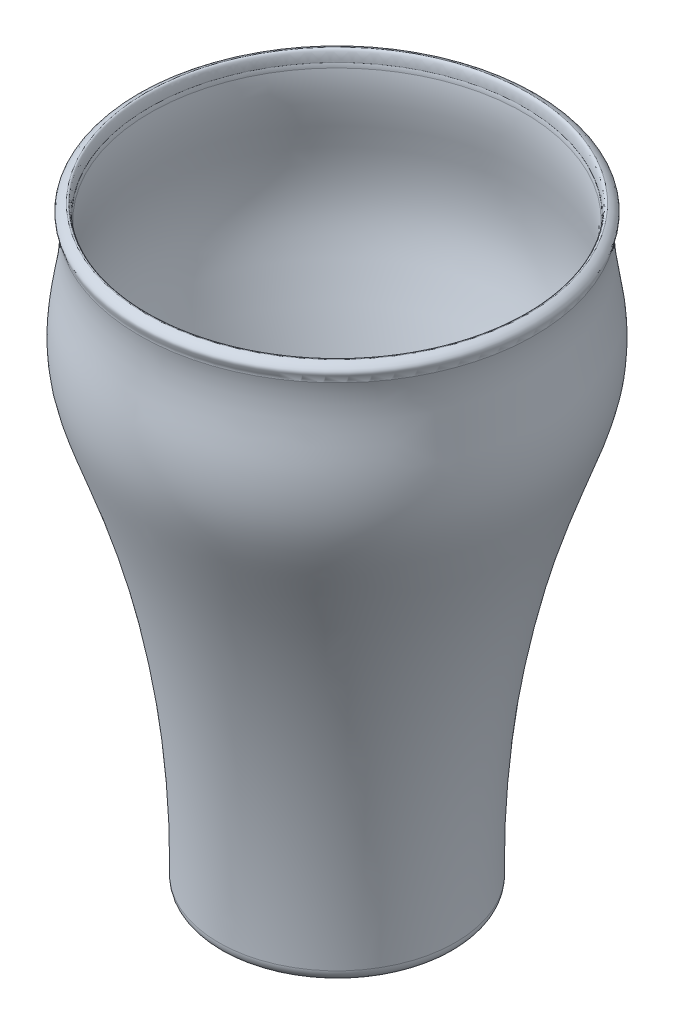
ISO-10303-21;
HEADER;
FILE_DESCRIPTION(('STEP AP214'),'2;1');
FILE_NAME('part.step','',(''),(''),'','','');
FILE_SCHEMA(('AUTOMOTIVE_DESIGN { 1 0 10303 214 1 1 1 1 }'));
ENDSEC;
DATA;
#1=APPLICATION_CONTEXT('core data for automotive mechanical design processes');
#2=APPLICATION_PROTOCOL_DEFINITION('international standard','automotive_design',2000,#1);
#3=PRODUCT_CONTEXT('',#1,'mechanical');
#4=PRODUCT('Part','Part','',(#3));
#5=PRODUCT_RELATED_PRODUCT_CATEGORY('part','',(#4));
#6=PRODUCT_DEFINITION_FORMATION('','',#4);
#7=PRODUCT_DEFINITION_CONTEXT('part definition',#1,'design');
#8=PRODUCT_DEFINITION('design','',#6,#7);
#9=PRODUCT_DEFINITION_SHAPE('','',#8);
#10=(LENGTH_UNIT() NAMED_UNIT(*) SI_UNIT(.MILLI.,.METRE.));
#11=(NAMED_UNIT(*) PLANE_ANGLE_UNIT() SI_UNIT($,.RADIAN.));
#12=(NAMED_UNIT(*) SI_UNIT($,.STERADIAN.) SOLID_ANGLE_UNIT());
#13=UNCERTAINTY_MEASURE_WITH_UNIT(LENGTH_MEASURE(1.E-05),#10,'distance_accuracy_value','');
#14=(GEOMETRIC_REPRESENTATION_CONTEXT(3) GLOBAL_UNCERTAINTY_ASSIGNED_CONTEXT((#13)) GLOBAL_UNIT_ASSIGNED_CONTEXT((#10,
#11,#12)) REPRESENTATION_CONTEXT('',''));
#15=CARTESIAN_POINT('',(0.,0.,0.));
#16=DIRECTION('',(0.,0.,1.));
#17=DIRECTION('',(1.,0.,0.));
#18=AXIS2_PLACEMENT_3D('',#15,#16,#17);
#19=CARTESIAN_POINT('',(-40.161712896509,67.7639787968205,0.));
#20=CARTESIAN_POINT('',(-40.2078607651038,67.5717075587349,0.));
#21=CARTESIAN_POINT('',(-40.1071310294182,70.3157519524283,0.));
#22=CARTESIAN_POINT('',(-40.982771359121,70.0372787968205,0.));
#23=B_SPLINE_CURVE_WITH_KNOTS('',3,(#19,#20,#21,#22),.UNSPECIFIED.,.F.,.F.,(4,4),(0.,1.),.UNSPECIFIED.);
#24=CARTESIAN_POINT('',(0.,70.0372787968205,0.));
#25=DIRECTION('',(0.,1.,0.));
#26=AXIS1_PLACEMENT('',#24,#25);
#27=SURFACE_OF_REVOLUTION('',#23,#26);
#28=CARTESIAN_POINT('',(0.,70.0372787968205,0.));
#29=DIRECTION('',(0.,1.,0.));
#30=DIRECTION('',(0.,0.,1.));
#31=AXIS2_PLACEMENT_3D('',#28,#29,#30);
#32=CIRCLE('',#31,40.982771359121);
#33=CARTESIAN_POINT('',(0.,70.0372787968205,40.982771359121));
#34=VERTEX_POINT('',#33);
#35=EDGE_CURVE('E55',#34,#34,#32,.T.);
#36=ORIENTED_EDGE('',*,*,#35,.T.);
#37=EDGE_LOOP('',(#36));
#38=FACE_BOUND('',#37,.T.);
#39=CARTESIAN_POINT('',(0.,67.7639787968204,0.));
#40=DIRECTION('',(0.,1.,0.));
#41=DIRECTION('',(0.,0.,1.));
#42=AXIS2_PLACEMENT_3D('',#39,#40,#41);
#43=CIRCLE('',#42,40.161712896509);
#44=CARTESIAN_POINT('',(0.,67.7639787968204,40.161712896509));
#45=VERTEX_POINT('',#44);
#46=EDGE_CURVE('E64',#45,#45,#43,.T.);
#47=ORIENTED_EDGE('',*,*,#46,.F.);
#48=EDGE_LOOP('',(#47));
#49=FACE_BOUND('',#48,.T.);
#50=ADVANCED_FACE('F35',(#38,#49),#27,.F.);
#51=CARTESIAN_POINT('',(-40.982771359121,70.0372787968205,0.));
#52=CARTESIAN_POINT('',(-41.2540907274996,69.9509931860201,0.));
#53=CARTESIAN_POINT('',(-42.0560883488878,69.5973016641883,0.));
#54=CARTESIAN_POINT('',(-43.2005948521179,68.4430159210826,0.));
#55=CARTESIAN_POINT('',(-42.2332897103566,67.3090777516899,0.));
#56=CARTESIAN_POINT('',(-42.2864520805664,66.6426140384527,0.));
#57=B_SPLINE_CURVE_WITH_KNOTS('',3,(#51,#52,#53,#54,#55,#56),.UNSPECIFIED.,.F.,.F.,(4,1,1,4),
(0.,0.262566933204371,0.525656658847653,1.),.UNSPECIFIED.);
#58=CARTESIAN_POINT('',(0.,70.0372787968205,0.));
#59=DIRECTION('',(0.,1.,0.));
#60=AXIS1_PLACEMENT('',#58,#59);
#61=SURFACE_OF_REVOLUTION('',#57,#60);
#62=CARTESIAN_POINT('',(0.,66.6426140384527,0.));
#63=DIRECTION('',(0.,1.,0.));
#64=DIRECTION('',(0.,0.,1.));
#65=AXIS2_PLACEMENT_3D('',#62,#63,#64);
#66=CIRCLE('',#65,42.2864520805664);
#67=CARTESIAN_POINT('',(0.,66.6426140384527,42.2864520805664));
#68=VERTEX_POINT('',#67);
#69=EDGE_CURVE('E58',#68,#68,#66,.T.);
#70=ORIENTED_EDGE('',*,*,#69,.T.);
#71=EDGE_LOOP('',(#70));
#72=FACE_BOUND('',#71,.T.);
#73=ORIENTED_EDGE('',*,*,#35,.F.);
#74=EDGE_LOOP('',(#73));
#75=FACE_BOUND('',#74,.T.);
#76=ADVANCED_FACE('F98',(#72,#75),#61,.F.);
#77=CARTESIAN_POINT('',(-42.2864520805664,66.6426140384527,0.));
#78=CARTESIAN_POINT('',(-41.7851341456587,63.8343197516039,0.));
#79=CARTESIAN_POINT('',(-42.2065413611083,58.4269283923178,0.));
#80=CARTESIAN_POINT('',(-43.9755250202174,49.6278971925327,0.));
#81=CARTESIAN_POINT('',(-44.1380980893129,39.0617469269642,0.));
#82=CARTESIAN_POINT('',(-40.0103161028563,27.5218041267874,0.));
#83=CARTESIAN_POINT('',(-28.8072692358302,-3.41779929685816,0.));
#84=CARTESIAN_POINT('',(-24.8923245590568,-32.5522426631839,0.));
#85=CARTESIAN_POINT('',(-25.4070828595563,-56.9627212031795,0.));
#86=B_SPLINE_CURVE_WITH_KNOTS('',3,(#77,#78,#79,#80,#81,#82,#83,#84,#85),.UNSPECIFIED.,.F.,.F.,
(4,1,1,1,1,1,4),(0.,0.0675260052343535,0.127886176615294,0.214327329654211,0.314756995417671,
0.416925229903026,1.),.UNSPECIFIED.);
#87=CARTESIAN_POINT('',(0.,70.0372787968205,0.));
#88=DIRECTION('',(0.,1.,0.));
#89=AXIS1_PLACEMENT('',#87,#88);
#90=SURFACE_OF_REVOLUTION('',#86,#89);
#91=CARTESIAN_POINT('',(0.,-54.3972602507916,0.));
#92=DIRECTION('',(0.,1.,0.));
#93=DIRECTION('',(0.,0.,1.));
#94=AXIS2_PLACEMENT_3D('',#91,#92,#93);
#95=CIRCLE('',#94,25.3671736585105);
#96=CARTESIAN_POINT('',(0.,-54.3972602507916,25.3671736585105));
#97=VERTEX_POINT('',#96);
#98=EDGE_CURVE('E42',#97,#97,#95,.T.);
#99=ORIENTED_EDGE('',*,*,#98,.T.);
#100=EDGE_LOOP('',(#99));
#101=FACE_BOUND('',#100,.T.);
#102=ORIENTED_EDGE('',*,*,#69,.F.);
#103=EDGE_LOOP('',(#102));
#104=FACE_BOUND('',#103,.T.);
#105=ADVANCED_FACE('F95',(#101,#104),#90,.F.);
#106=CARTESIAN_POINT('',(-25.4070828595563,-56.9627212031795,0.));
#107=DIRECTION('',(0.,-1.,0.));
#108=DIRECTION('',(0.,0.,-1.));
#109=AXIS2_PLACEMENT_3D('',#106,#107,#108);
#110=PLANE('',#109);
#111=CARTESIAN_POINT('',(0.,-56.9627212031795,0.));
#112=DIRECTION('',(0.,-1.,0.));
#113=DIRECTION('',(0.,0.,-1.));
#114=AXIS2_PLACEMENT_3D('',#111,#112,#113);
#115=CIRCLE('',#114,22.8273012719715);
#116=CARTESIAN_POINT('',(0.,-56.9627212031795,-22.8273012719715));
#117=VERTEX_POINT('',#116);
#118=EDGE_CURVE('E10',#117,#117,#115,.T.);
#119=ORIENTED_EDGE('',*,*,#118,.T.);
#120=EDGE_LOOP('',(#119));
#121=FACE_BOUND('',#120,.T.);
#122=ADVANCED_FACE('F91',(#121),#110,.T.);
#123=CARTESIAN_POINT('',(-23.0968431742677,-54.6894212031795,0.));
#124=DIRECTION('',(0.,1.,0.));
#125=DIRECTION('',(0.,0.,1.));
#126=AXIS2_PLACEMENT_3D('',#123,#124,#125);
#127=PLANE('',#126);
#128=CARTESIAN_POINT('',(0.,-54.6894212031795,0.));
#129=DIRECTION('',(0.,1.,0.));
#130=DIRECTION('',(0.,0.,1.));
#131=AXIS2_PLACEMENT_3D('',#128,#129,#130);
#132=CIRCLE('',#131,20.5422025735924);
#133=CARTESIAN_POINT('',(0.,-54.6894212031795,20.5422025735924));
#134=VERTEX_POINT('',#133);
#135=EDGE_CURVE('E50',#134,#134,#132,.T.);
#136=ORIENTED_EDGE('',*,*,#135,.T.);
#137=EDGE_LOOP('',(#136));
#138=FACE_BOUND('',#137,.T.);
#139=ADVANCED_FACE('F87',(#138),#127,.T.);
#140=CARTESIAN_POINT('',(-23.0968431742677,-54.6894212031795,0.));
#141=CARTESIAN_POINT('',(-23.0388018808749,-49.4956010295479,0.));
#142=CARTESIAN_POINT('',(-23.2671468092924,-39.1117391751753,0.));
#143=CARTESIAN_POINT('',(-24.6640408221197,-23.5304935903916,0.));
#144=CARTESIAN_POINT('',(-27.1385340711321,-8.08213544029553,0.));
#145=CARTESIAN_POINT('',(-30.118090666955,4.59327544088663,0.));
#146=CARTESIAN_POINT('',(-33.063765775765,14.5721306034255,0.));
#147=CARTESIAN_POINT('',(-35.5578305099025,21.9301697556452,0.));
#148=CARTESIAN_POINT('',(-38.2199467397921,29.2318545284125,0.));
#149=CARTESIAN_POINT('',(-40.3025451650946,35.2101062461546,0.));
#150=CARTESIAN_POINT('',(-41.3249648057782,39.917518024567,0.));
#151=CARTESIAN_POINT('',(-41.6726926133105,43.4964507904898,0.));
#152=CARTESIAN_POINT('',(-41.6499140273339,47.1720767326186,0.));
#153=CARTESIAN_POINT('',(-41.1877643334059,52.0481291724909,0.));
#154=CARTESIAN_POINT('',(-40.1657108551781,57.0558543785063,0.));
#155=CARTESIAN_POINT('',(-39.6955868407625,61.8472941941081,0.));
#156=CARTESIAN_POINT('',(-39.7342856442041,64.6647024235412,0.));
#157=CARTESIAN_POINT('',(-39.892609452884,66.1153693405419,0.));
#158=CARTESIAN_POINT('',(-40.0114661175859,66.8274868068968,0.));
#159=B_SPLINE_CURVE_WITH_KNOTS('',3,(#140,#141,#142,#143,#144,#145,#146,#147,#148,#149,#150,
#151,#152,#153,#154,#155,#156,#157,#158),.UNSPECIFIED.,.F.,.F.,(4,1,1,1,1,1,1,1,1,1,1,1,1,1,1,1,
4),(0.00151731272923951,0.124040898531078,0.246564484332917,0.369088070134756,0.491611655936594,
0.552873448837513,0.614135241738433,0.675397034639352,0.736658827540272,0.767289723990731,
0.797920620441191,0.828551516891651,0.85918241334211,0.920444206243029,0.951075102693489,
0.966390550918719,0.981705999143949),.UNSPECIFIED.);
#160=CARTESIAN_POINT('',(0.,70.0372787968205,0.));
#161=DIRECTION('',(0.,1.,0.));
#162=AXIS1_PLACEMENT('',#160,#161);
#163=SURFACE_OF_REVOLUTION('',#159,#162);
#164=CARTESIAN_POINT('',(0.,-52.1485511505559,0.));
#165=DIRECTION('',(0.,1.,0.));
#166=DIRECTION('',(0.,0.,1.));
#167=AXIS2_PLACEMENT_3D('',#164,#165,#166);
#168=CIRCLE('',#167,23.0822024245783);
#169=CARTESIAN_POINT('',(0.,-52.1485511505559,23.0822024245783));
#170=VERTEX_POINT('',#169);
#171=EDGE_CURVE('E46',#170,#170,#168,.F.);
#172=ORIENTED_EDGE('',*,*,#171,.T.);
#173=EDGE_LOOP('',(#172));
#174=FACE_BOUND('',#173,.T.);
#175=CARTESIAN_POINT('',(0.,66.8274868068968,0.));
#176=DIRECTION('',(0.,1.,0.));
#177=DIRECTION('',(0.,0.,1.));
#178=AXIS2_PLACEMENT_3D('',#175,#176,#177);
#179=CIRCLE('',#178,40.0114661175859);
#180=CARTESIAN_POINT('',(0.,66.8274868068968,40.0114661175859));
#181=VERTEX_POINT('',#180);
#182=EDGE_CURVE('E61',#181,#181,#179,.T.);
#183=ORIENTED_EDGE('',*,*,#182,.T.);
#184=EDGE_LOOP('',(#183));
#185=FACE_BOUND('',#184,.T.);
#186=ADVANCED_FACE('F83',(#174,#185),#163,.F.);
#187=CARTESIAN_POINT('',(-40.0114661175859,66.8274868068968,0.));
#188=CARTESIAN_POINT('',(-40.0142032808106,66.9183107443465,0.));
#189=CARTESIAN_POINT('',(-40.0277667050731,67.1058024024993,0.));
#190=CARTESIAN_POINT('',(-40.0635241005001,67.3487962790065,0.));
#191=CARTESIAN_POINT('',(-40.1101848510301,67.5720530106901,0.));
#192=CARTESIAN_POINT('',(-40.1432353860497,67.6985362970015,0.));
#193=CARTESIAN_POINT('',(-40.161712896509,67.7639787968204,0.));
#194=B_SPLINE_CURVE_WITH_KNOTS('',3,(#187,#188,#189,#190,#191,#192,#193),.UNSPECIFIED.,.F.,.F.,
(4,1,1,1,4),(0.882607163181234,0.905087451232894,0.927567739284554,0.950048027336214,
0.972528315387874),.UNSPECIFIED.);
#195=CARTESIAN_POINT('',(0.,70.0372787968205,0.));
#196=DIRECTION('',(0.,1.,0.));
#197=AXIS1_PLACEMENT('',#195,#196);
#198=SURFACE_OF_REVOLUTION('',#194,#197);
#199=ORIENTED_EDGE('',*,*,#46,.T.);
#200=EDGE_LOOP('',(#199));
#201=FACE_BOUND('',#200,.T.);
#202=ORIENTED_EDGE('',*,*,#182,.F.);
#203=EDGE_LOOP('',(#202));
#204=FACE_BOUND('',#203,.T.);
#205=ADVANCED_FACE('F79',(#201,#204),#198,.F.);
#206=CARTESIAN_POINT('',(0.,-52.1494212031795,0.));
#207=DIRECTION('',(0.,1.,0.));
#208=DIRECTION('',(0.,0.,1.));
#209=AXIS2_PLACEMENT_3D('',#206,#207,#208);
#210=TOROIDAL_SURFACE('',#209,20.5422025735924,2.54);
#211=ORIENTED_EDGE('',*,*,#171,.F.);
#212=EDGE_LOOP('',(#211));
#213=FACE_BOUND('',#212,.T.);
#214=ORIENTED_EDGE('',*,*,#135,.F.);
#215=EDGE_LOOP('',(#214));
#216=FACE_BOUND('',#215,.T.);
#217=ADVANCED_FACE('F82',(#213,#216),#210,.F.);
#218=CARTESIAN_POINT('',(0.,-54.4227212031794,0.));
#219=DIRECTION('',(0.,1.,0.));
#220=DIRECTION('',(0.,0.,1.));
#221=AXIS2_PLACEMENT_3D('',#218,#219,#220);
#222=TOROIDAL_SURFACE('',#221,22.8273012719715,2.54);
#223=ORIENTED_EDGE('',*,*,#118,.F.);
#224=EDGE_LOOP('',(#223));
#225=FACE_BOUND('',#224,.T.);
#226=ORIENTED_EDGE('',*,*,#98,.F.);
#227=EDGE_LOOP('',(#226));
#228=FACE_BOUND('',#227,.T.);
#229=ADVANCED_FACE('F37',(#225,#228),#222,.T.);
#230=CLOSED_SHELL('',(#50,#76,#105,#122,#139,#186,#205,#217,#229));
#231=MANIFOLD_SOLID_BREP('B2',#230);
#232=ADVANCED_BREP_SHAPE_REPRESENTATION('',(#18,#231),#14);
#233=SHAPE_DEFINITION_REPRESENTATION(#9,#232);
ENDSEC;
END-ISO-10303-21;
